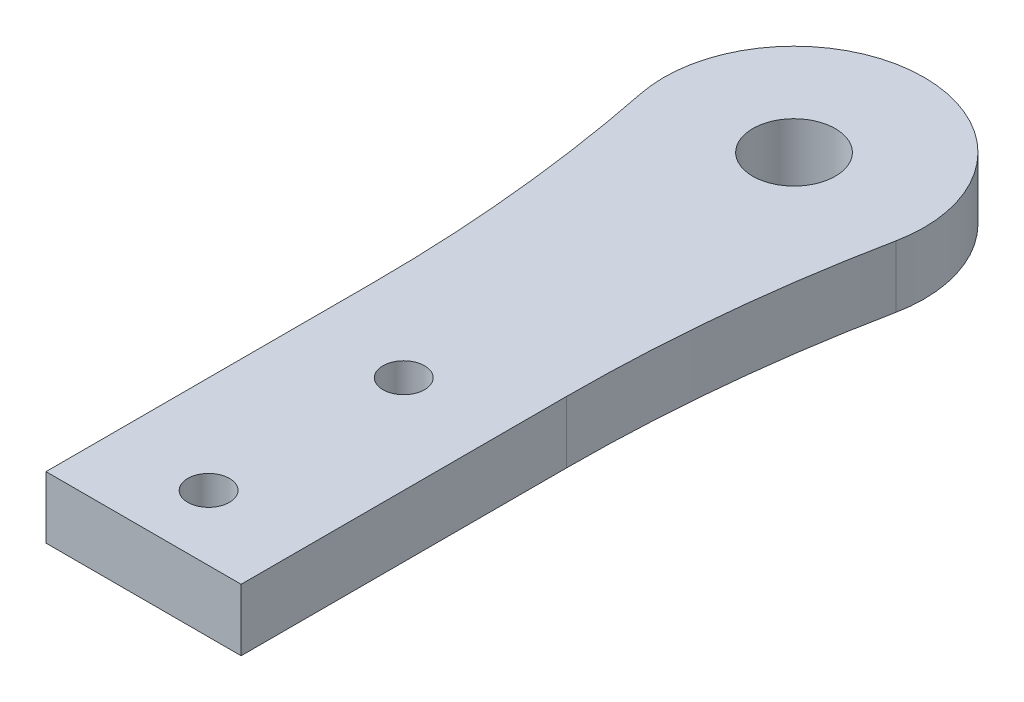
ISO-10303-21;
HEADER;
FILE_DESCRIPTION(('STEP AP214'),'2;1');
FILE_NAME('part.step','',(''),(''),'','','');
FILE_SCHEMA(('AUTOMOTIVE_DESIGN { 1 0 10303 214 1 1 1 1 }'));
ENDSEC;
DATA;
#1=APPLICATION_CONTEXT('core data for automotive mechanical design processes');
#2=APPLICATION_PROTOCOL_DEFINITION('international standard','automotive_design',2000,#1);
#3=PRODUCT_CONTEXT('',#1,'mechanical');
#4=PRODUCT('Part','Part','',(#3));
#5=PRODUCT_RELATED_PRODUCT_CATEGORY('part','',(#4));
#6=PRODUCT_DEFINITION_FORMATION('','',#4);
#7=PRODUCT_DEFINITION_CONTEXT('part definition',#1,'design');
#8=PRODUCT_DEFINITION('design','',#6,#7);
#9=PRODUCT_DEFINITION_SHAPE('','',#8);
#10=(LENGTH_UNIT() NAMED_UNIT(*) SI_UNIT(.MILLI.,.METRE.));
#11=(NAMED_UNIT(*) PLANE_ANGLE_UNIT() SI_UNIT($,.RADIAN.));
#12=(NAMED_UNIT(*) SI_UNIT($,.STERADIAN.) SOLID_ANGLE_UNIT());
#13=UNCERTAINTY_MEASURE_WITH_UNIT(LENGTH_MEASURE(1.E-05),#10,'distance_accuracy_value','');
#14=(GEOMETRIC_REPRESENTATION_CONTEXT(3) GLOBAL_UNCERTAINTY_ASSIGNED_CONTEXT((#13)) GLOBAL_UNIT_ASSIGNED_CONTEXT((#10,
#11,#12)) REPRESENTATION_CONTEXT('',''));
#15=CARTESIAN_POINT('',(0.,0.,0.));
#16=DIRECTION('',(0.,0.,1.));
#17=DIRECTION('',(1.,0.,0.));
#18=AXIS2_PLACEMENT_3D('',#15,#16,#17);
#19=CARTESIAN_POINT('',(123.75,4.7625,-25.));
#20=DIRECTION('',(0.,-1.,0.));
#21=DIRECTION('',(0.,0.,-1.));
#22=AXIS2_PLACEMENT_3D('',#19,#20,#21);
#23=PLANE('',#22);
#24=CARTESIAN_POINT('',(0.,4.7625,-5.));
#25=DIRECTION('',(0.,1.,0.));
#26=DIRECTION('',(0.,0.,1.));
#27=AXIS2_PLACEMENT_3D('',#24,#25,#26);
#28=CIRCLE('',#27,1.6);
#29=CARTESIAN_POINT('',(0.,4.7625,-3.4));
#30=VERTEX_POINT('',#29);
#31=EDGE_CURVE('E185',#30,#30,#28,.T.);
#32=ORIENTED_EDGE('',*,*,#31,.F.);
#33=EDGE_LOOP('',(#32));
#34=FACE_BOUND('',#33,.T.);
#35=DIRECTION('',(0.,0.,1.));
#36=VECTOR('',#35,1.);
#37=CARTESIAN_POINT('',(-7.5,4.7625,-25.));
#38=LINE('',#37,#36);
#39=CARTESIAN_POINT('',(-7.50000000000001,4.7625,-25.));
#40=VERTEX_POINT('',#39);
#41=CARTESIAN_POINT('',(-7.5,4.7625,0.));
#42=VERTEX_POINT('',#41);
#43=EDGE_CURVE('E129',#40,#42,#38,.T.);
#44=ORIENTED_EDGE('',*,*,#43,.T.);
#45=DIRECTION('',(1.,0.,0.));
#46=VECTOR('',#45,1.);
#47=CARTESIAN_POINT('',(-7.5,4.7625,0.));
#48=LINE('',#47,#46);
#49=CARTESIAN_POINT('',(7.5,4.7625,0.));
#50=VERTEX_POINT('',#49);
#51=EDGE_CURVE('E87',#42,#50,#48,.T.);
#52=ORIENTED_EDGE('',*,*,#51,.T.);
#53=DIRECTION('',(0.,0.,-1.));
#54=VECTOR('',#53,1.);
#55=CARTESIAN_POINT('',(7.5,4.7625,0.));
#56=LINE('',#55,#54);
#57=CARTESIAN_POINT('',(7.5,4.7625,-25.));
#58=VERTEX_POINT('',#57);
#59=EDGE_CURVE('E100',#50,#58,#56,.T.);
#60=ORIENTED_EDGE('',*,*,#59,.T.);
#61=CARTESIAN_POINT('',(123.75,4.7625,-25.));
#62=DIRECTION('',(0.,-1.,0.));
#63=DIRECTION('',(0.,0.,-1.));
#64=AXIS2_PLACEMENT_3D('',#61,#62,#63);
#65=CIRCLE('',#64,116.25);
#66=CARTESIAN_POINT('',(9.8019801980198,4.7625,-48.019801980198));
#67=VERTEX_POINT('',#66);
#68=EDGE_CURVE('E94',#58,#67,#65,.T.);
#69=ORIENTED_EDGE('',*,*,#68,.T.);
#70=CARTESIAN_POINT('',(0.,4.7625,-50.));
#71=DIRECTION('',(0.,1.,0.));
#72=DIRECTION('',(0.,0.,1.));
#73=AXIS2_PLACEMENT_3D('',#70,#71,#72);
#74=CIRCLE('',#73,10.);
#75=CARTESIAN_POINT('',(-9.8019801980198,4.7625,-48.019801980198));
#76=VERTEX_POINT('',#75);
#77=EDGE_CURVE('E98',#67,#76,#74,.T.);
#78=ORIENTED_EDGE('',*,*,#77,.T.);
#79=CARTESIAN_POINT('',(-123.75,4.7625,-25.));
#80=DIRECTION('',(0.,-1.,0.));
#81=DIRECTION('',(0.,0.,-1.));
#82=AXIS2_PLACEMENT_3D('',#79,#80,#81);
#83=CIRCLE('',#82,116.25);
#84=EDGE_CURVE('E50',#76,#40,#83,.T.);
#85=ORIENTED_EDGE('',*,*,#84,.T.);
#86=EDGE_LOOP('',(#44,#52,#60,#69,#78,#85));
#87=FACE_BOUND('',#86,.T.);
#88=CARTESIAN_POINT('',(0.,4.7625,-50.));
#89=DIRECTION('',(0.,1.,0.));
#90=DIRECTION('',(0.,0.,1.));
#91=AXIS2_PLACEMENT_3D('',#88,#89,#90);
#92=CIRCLE('',#91,3.175);
#93=CARTESIAN_POINT('',(0.,4.7625,-46.825));
#94=VERTEX_POINT('',#93);
#95=EDGE_CURVE('E122',#94,#94,#92,.T.);
#96=ORIENTED_EDGE('',*,*,#95,.F.);
#97=EDGE_LOOP('',(#96));
#98=FACE_BOUND('',#97,.T.);
#99=CARTESIAN_POINT('',(0.,4.7625,-20.));
#100=DIRECTION('',(0.,1.,0.));
#101=DIRECTION('',(0.,0.,1.));
#102=AXIS2_PLACEMENT_3D('',#99,#100,#101);
#103=CIRCLE('',#102,1.6);
#104=CARTESIAN_POINT('',(0.,4.7625,-18.4));
#105=VERTEX_POINT('',#104);
#106=EDGE_CURVE('E176',#105,#105,#103,.T.);
#107=ORIENTED_EDGE('',*,*,#106,.F.);
#108=EDGE_LOOP('',(#107));
#109=FACE_BOUND('',#108,.T.);
#110=ADVANCED_FACE('F33',(#34,#87,#98,#109),#23,.F.);
#111=CARTESIAN_POINT('',(123.75,0.,-25.));
#112=DIRECTION('',(0.,-1.,0.));
#113=DIRECTION('',(0.,0.,-1.));
#114=AXIS2_PLACEMENT_3D('',#111,#112,#113);
#115=PLANE('',#114);
#116=CARTESIAN_POINT('',(0.,0.,-5.));
#117=DIRECTION('',(0.,1.,0.));
#118=DIRECTION('',(0.,0.,1.));
#119=AXIS2_PLACEMENT_3D('',#116,#117,#118);
#120=CIRCLE('',#119,1.6);
#121=CARTESIAN_POINT('',(0.,0.,-3.4));
#122=VERTEX_POINT('',#121);
#123=EDGE_CURVE('E182',#122,#122,#120,.T.);
#124=ORIENTED_EDGE('',*,*,#123,.T.);
#125=EDGE_LOOP('',(#124));
#126=FACE_BOUND('',#125,.T.);
#127=DIRECTION('',(0.,0.,1.));
#128=VECTOR('',#127,1.);
#129=CARTESIAN_POINT('',(-7.5,0.,-25.));
#130=LINE('',#129,#128);
#131=CARTESIAN_POINT('',(-7.50000000000001,0.,-25.));
#132=VERTEX_POINT('',#131);
#133=CARTESIAN_POINT('',(-7.5,0.,0.));
#134=VERTEX_POINT('',#133);
#135=EDGE_CURVE('E118',#132,#134,#130,.T.);
#136=ORIENTED_EDGE('',*,*,#135,.F.);
#137=CARTESIAN_POINT('',(-123.75,0.,-25.));
#138=DIRECTION('',(0.,-1.,0.));
#139=DIRECTION('',(0.,0.,-1.));
#140=AXIS2_PLACEMENT_3D('',#137,#138,#139);
#141=CIRCLE('',#140,116.25);
#142=CARTESIAN_POINT('',(-9.8019801980198,0.,-48.019801980198));
#143=VERTEX_POINT('',#142);
#144=EDGE_CURVE('E79',#143,#132,#141,.T.);
#145=ORIENTED_EDGE('',*,*,#144,.F.);
#146=CARTESIAN_POINT('',(0.,0.,-50.));
#147=DIRECTION('',(0.,1.,0.));
#148=DIRECTION('',(0.,0.,1.));
#149=AXIS2_PLACEMENT_3D('',#146,#147,#148);
#150=CIRCLE('',#149,10.);
#151=CARTESIAN_POINT('',(9.8019801980198,0.,-48.019801980198));
#152=VERTEX_POINT('',#151);
#153=EDGE_CURVE('E73',#152,#143,#150,.T.);
#154=ORIENTED_EDGE('',*,*,#153,.F.);
#155=CARTESIAN_POINT('',(123.75,0.,-25.));
#156=DIRECTION('',(0.,-1.,0.));
#157=DIRECTION('',(0.,0.,-1.));
#158=AXIS2_PLACEMENT_3D('',#155,#156,#157);
#159=CIRCLE('',#158,116.25);
#160=CARTESIAN_POINT('',(7.5,0.,-25.));
#161=VERTEX_POINT('',#160);
#162=EDGE_CURVE('E108',#161,#152,#159,.T.);
#163=ORIENTED_EDGE('',*,*,#162,.F.);
#164=DIRECTION('',(0.,0.,-1.));
#165=VECTOR('',#164,1.);
#166=CARTESIAN_POINT('',(7.5,0.,0.));
#167=LINE('',#166,#165);
#168=CARTESIAN_POINT('',(7.5,0.,0.));
#169=VERTEX_POINT('',#168);
#170=EDGE_CURVE('E124',#169,#161,#167,.T.);
#171=ORIENTED_EDGE('',*,*,#170,.F.);
#172=DIRECTION('',(1.,0.,0.));
#173=VECTOR('',#172,1.);
#174=CARTESIAN_POINT('',(-7.5,0.,0.));
#175=LINE('',#174,#173);
#176=EDGE_CURVE('E121',#134,#169,#175,.T.);
#177=ORIENTED_EDGE('',*,*,#176,.F.);
#178=EDGE_LOOP('',(#136,#145,#154,#163,#171,#177));
#179=FACE_BOUND('',#178,.T.);
#180=CARTESIAN_POINT('',(0.,0.,-50.));
#181=DIRECTION('',(0.,1.,0.));
#182=DIRECTION('',(0.,0.,1.));
#183=AXIS2_PLACEMENT_3D('',#180,#181,#182);
#184=CIRCLE('',#183,3.175);
#185=CARTESIAN_POINT('',(0.,0.,-46.825));
#186=VERTEX_POINT('',#185);
#187=EDGE_CURVE('E188',#186,#186,#184,.T.);
#188=ORIENTED_EDGE('',*,*,#187,.T.);
#189=EDGE_LOOP('',(#188));
#190=FACE_BOUND('',#189,.T.);
#191=CARTESIAN_POINT('',(0.,0.,-20.));
#192=DIRECTION('',(0.,1.,0.));
#193=DIRECTION('',(0.,0.,1.));
#194=AXIS2_PLACEMENT_3D('',#191,#192,#193);
#195=CIRCLE('',#194,1.6);
#196=CARTESIAN_POINT('',(0.,0.,-18.4));
#197=VERTEX_POINT('',#196);
#198=EDGE_CURVE('E179',#197,#197,#195,.T.);
#199=ORIENTED_EDGE('',*,*,#198,.T.);
#200=EDGE_LOOP('',(#199));
#201=FACE_BOUND('',#200,.T.);
#202=ADVANCED_FACE('F138',(#126,#179,#190,#201),#115,.T.);
#203=CARTESIAN_POINT('',(-7.5,4.7625,-25.));
#204=DIRECTION('',(1.,0.,0.));
#205=DIRECTION('',(0.,0.,-1.));
#206=AXIS2_PLACEMENT_3D('',#203,#204,#205);
#207=PLANE('',#206);
#208=ORIENTED_EDGE('',*,*,#135,.T.);
#209=DIRECTION('',(0.,-1.,0.));
#210=VECTOR('',#209,1.);
#211=CARTESIAN_POINT('',(-7.5,4.7625,0.));
#212=LINE('',#211,#210);
#213=EDGE_CURVE('E11',#42,#134,#212,.T.);
#214=ORIENTED_EDGE('',*,*,#213,.F.);
#215=ORIENTED_EDGE('',*,*,#43,.F.);
#216=DIRECTION('',(0.,-1.,0.));
#217=VECTOR('',#216,1.);
#218=CARTESIAN_POINT('',(-7.50000000000001,4.7625,-25.));
#219=LINE('',#218,#217);
#220=EDGE_CURVE('E114',#40,#132,#219,.T.);
#221=ORIENTED_EDGE('',*,*,#220,.T.);
#222=EDGE_LOOP('',(#208,#214,#215,#221));
#223=FACE_BOUND('',#222,.T.);
#224=ADVANCED_FACE('F35',(#223),#207,.F.);
#225=CARTESIAN_POINT('',(-7.5,4.7625,0.));
#226=DIRECTION('',(0.,0.,-1.));
#227=DIRECTION('',(-1.,0.,0.));
#228=AXIS2_PLACEMENT_3D('',#225,#226,#227);
#229=PLANE('',#228);
#230=ORIENTED_EDGE('',*,*,#176,.T.);
#231=DIRECTION('',(0.,-1.,0.));
#232=VECTOR('',#231,1.);
#233=CARTESIAN_POINT('',(7.5,4.7625,0.));
#234=LINE('',#233,#232);
#235=EDGE_CURVE('E42',#50,#169,#234,.T.);
#236=ORIENTED_EDGE('',*,*,#235,.F.);
#237=ORIENTED_EDGE('',*,*,#51,.F.);
#238=ORIENTED_EDGE('',*,*,#213,.T.);
#239=EDGE_LOOP('',(#230,#236,#237,#238));
#240=FACE_BOUND('',#239,.T.);
#241=ADVANCED_FACE('F237',(#240),#229,.F.);
#242=CARTESIAN_POINT('',(7.5,4.7625,0.));
#243=DIRECTION('',(-1.,0.,0.));
#244=DIRECTION('',(0.,0.,1.));
#245=AXIS2_PLACEMENT_3D('',#242,#243,#244);
#246=PLANE('',#245);
#247=ORIENTED_EDGE('',*,*,#170,.T.);
#248=DIRECTION('',(0.,-1.,0.));
#249=VECTOR('',#248,1.);
#250=CARTESIAN_POINT('',(7.5,4.7625,-25.));
#251=LINE('',#250,#249);
#252=EDGE_CURVE('E109',#58,#161,#251,.T.);
#253=ORIENTED_EDGE('',*,*,#252,.F.);
#254=ORIENTED_EDGE('',*,*,#59,.F.);
#255=ORIENTED_EDGE('',*,*,#235,.T.);
#256=EDGE_LOOP('',(#247,#253,#254,#255));
#257=FACE_BOUND('',#256,.T.);
#258=ADVANCED_FACE('F135',(#257),#246,.F.);
#259=CARTESIAN_POINT('',(123.75,4.7625,-25.));
#260=DIRECTION('',(0.,-1.,0.));
#261=DIRECTION('',(0.,0.,-1.));
#262=AXIS2_PLACEMENT_3D('',#259,#260,#261);
#263=CYLINDRICAL_SURFACE('',#262,116.25);
#264=ORIENTED_EDGE('',*,*,#162,.T.);
#265=DIRECTION('',(0.,-1.,0.));
#266=VECTOR('',#265,1.);
#267=CARTESIAN_POINT('',(9.8019801980198,4.7625,-48.019801980198));
#268=LINE('',#267,#266);
#269=EDGE_CURVE('E105',#67,#152,#268,.T.);
#270=ORIENTED_EDGE('',*,*,#269,.F.);
#271=ORIENTED_EDGE('',*,*,#68,.F.);
#272=ORIENTED_EDGE('',*,*,#252,.T.);
#273=EDGE_LOOP('',(#264,#270,#271,#272));
#274=FACE_BOUND('',#273,.T.);
#275=ADVANCED_FACE('F106',(#274),#263,.F.);
#276=CARTESIAN_POINT('',(0.,4.7625,-50.));
#277=DIRECTION('',(0.,-1.,0.));
#278=DIRECTION('',(0.,0.,-1.));
#279=AXIS2_PLACEMENT_3D('',#276,#277,#278);
#280=CYLINDRICAL_SURFACE('',#279,10.);
#281=ORIENTED_EDGE('',*,*,#153,.T.);
#282=DIRECTION('',(0.,-1.,0.));
#283=VECTOR('',#282,1.);
#284=CARTESIAN_POINT('',(-9.8019801980198,4.7625,-48.019801980198));
#285=LINE('',#284,#283);
#286=EDGE_CURVE('E110',#76,#143,#285,.T.);
#287=ORIENTED_EDGE('',*,*,#286,.F.);
#288=ORIENTED_EDGE('',*,*,#77,.F.);
#289=ORIENTED_EDGE('',*,*,#269,.T.);
#290=EDGE_LOOP('',(#281,#287,#288,#289));
#291=FACE_BOUND('',#290,.T.);
#292=ADVANCED_FACE('F112',(#291),#280,.T.);
#293=CARTESIAN_POINT('',(-123.75,4.7625,-25.));
#294=DIRECTION('',(0.,-1.,0.));
#295=DIRECTION('',(0.,0.,-1.));
#296=AXIS2_PLACEMENT_3D('',#293,#294,#295);
#297=CYLINDRICAL_SURFACE('',#296,116.25);
#298=ORIENTED_EDGE('',*,*,#144,.T.);
#299=ORIENTED_EDGE('',*,*,#220,.F.);
#300=ORIENTED_EDGE('',*,*,#84,.F.);
#301=ORIENTED_EDGE('',*,*,#286,.T.);
#302=EDGE_LOOP('',(#298,#299,#300,#301));
#303=FACE_BOUND('',#302,.T.);
#304=ADVANCED_FACE('F143',(#303),#297,.F.);
#305=CARTESIAN_POINT('',(0.,4.7625,-50.));
#306=DIRECTION('',(0.,-1.,0.));
#307=DIRECTION('',(0.,0.,-1.));
#308=AXIS2_PLACEMENT_3D('',#305,#306,#307);
#309=CYLINDRICAL_SURFACE('',#308,3.175);
#310=ORIENTED_EDGE('',*,*,#95,.T.);
#311=EDGE_LOOP('',(#310));
#312=FACE_BOUND('',#311,.T.);
#313=ORIENTED_EDGE('',*,*,#187,.F.);
#314=EDGE_LOOP('',(#313));
#315=FACE_BOUND('',#314,.T.);
#316=ADVANCED_FACE('F145',(#312,#315),#309,.F.);
#317=CARTESIAN_POINT('',(0.,4.7625,-5.));
#318=DIRECTION('',(0.,-1.,0.));
#319=DIRECTION('',(0.,0.,-1.));
#320=AXIS2_PLACEMENT_3D('',#317,#318,#319);
#321=CYLINDRICAL_SURFACE('',#320,1.6);
#322=ORIENTED_EDGE('',*,*,#31,.T.);
#323=EDGE_LOOP('',(#322));
#324=FACE_BOUND('',#323,.T.);
#325=ORIENTED_EDGE('',*,*,#123,.F.);
#326=EDGE_LOOP('',(#325));
#327=FACE_BOUND('',#326,.T.);
#328=ADVANCED_FACE('F151',(#324,#327),#321,.F.);
#329=CARTESIAN_POINT('',(0.,4.7625,-20.));
#330=DIRECTION('',(0.,-1.,0.));
#331=DIRECTION('',(0.,0.,-1.));
#332=AXIS2_PLACEMENT_3D('',#329,#330,#331);
#333=CYLINDRICAL_SURFACE('',#332,1.6);
#334=ORIENTED_EDGE('',*,*,#106,.T.);
#335=EDGE_LOOP('',(#334));
#336=FACE_BOUND('',#335,.T.);
#337=ORIENTED_EDGE('',*,*,#198,.F.);
#338=EDGE_LOOP('',(#337));
#339=FACE_BOUND('',#338,.T.);
#340=ADVANCED_FACE('F167',(#336,#339),#333,.F.);
#341=CLOSED_SHELL('',(#110,#202,#224,#241,#258,#275,#292,#304,#316,#328,#340));
#342=MANIFOLD_SOLID_BREP('B2',#341);
#343=ADVANCED_BREP_SHAPE_REPRESENTATION('',(#18,#342),#14);
#344=SHAPE_DEFINITION_REPRESENTATION(#9,#343);
ENDSEC;
END-ISO-10303-21;
